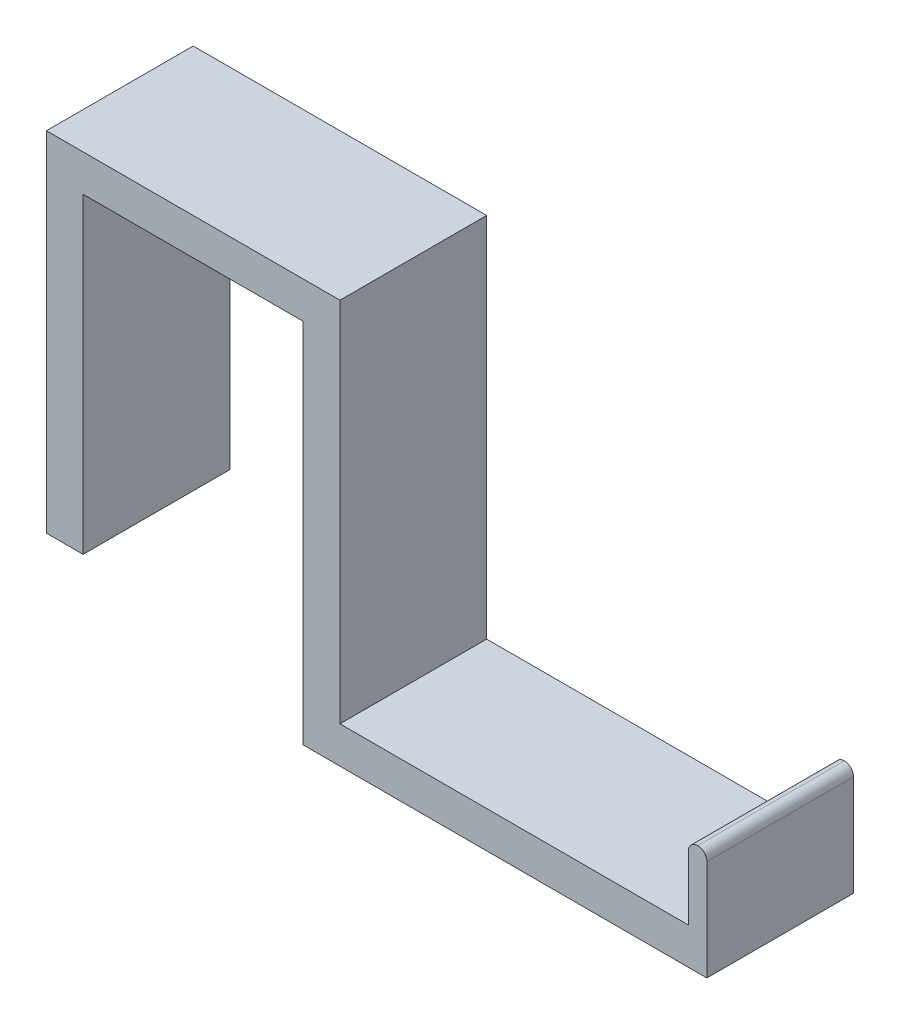
ISO-10303-21;
HEADER;
FILE_DESCRIPTION(('STEP AP214'),'2;1');
FILE_NAME('part.step','',(''),(''),'','','');
FILE_SCHEMA(('AUTOMOTIVE_DESIGN { 1 0 10303 214 1 1 1 1 }'));
ENDSEC;
DATA;
#1=APPLICATION_CONTEXT('core data for automotive mechanical design processes');
#2=APPLICATION_PROTOCOL_DEFINITION('international standard','automotive_design',2000,#1);
#3=PRODUCT_CONTEXT('',#1,'mechanical');
#4=PRODUCT('Part','Part','',(#3));
#5=PRODUCT_RELATED_PRODUCT_CATEGORY('part','',(#4));
#6=PRODUCT_DEFINITION_FORMATION('','',#4);
#7=PRODUCT_DEFINITION_CONTEXT('part definition',#1,'design');
#8=PRODUCT_DEFINITION('design','',#6,#7);
#9=PRODUCT_DEFINITION_SHAPE('','',#8);
#10=(LENGTH_UNIT() NAMED_UNIT(*) SI_UNIT(.MILLI.,.METRE.));
#11=(NAMED_UNIT(*) PLANE_ANGLE_UNIT() SI_UNIT($,.RADIAN.));
#12=(NAMED_UNIT(*) SI_UNIT($,.STERADIAN.) SOLID_ANGLE_UNIT());
#13=UNCERTAINTY_MEASURE_WITH_UNIT(LENGTH_MEASURE(1.E-05),#10,'distance_accuracy_value','');
#14=(GEOMETRIC_REPRESENTATION_CONTEXT(3) GLOBAL_UNCERTAINTY_ASSIGNED_CONTEXT((#13)) GLOBAL_UNIT_ASSIGNED_CONTEXT((#10,
#11,#12)) REPRESENTATION_CONTEXT('',''));
#15=CARTESIAN_POINT('',(0.,0.,0.));
#16=DIRECTION('',(0.,0.,1.));
#17=DIRECTION('',(1.,0.,0.));
#18=AXIS2_PLACEMENT_3D('',#15,#16,#17);
#19=CARTESIAN_POINT('',(-39.7323914253897,0.,40.));
#20=DIRECTION('',(1.,0.,0.));
#21=DIRECTION('',(0.,1.,0.));
#22=AXIS2_PLACEMENT_3D('',#19,#20,#21);
#23=PLANE('',#22);
#24=DIRECTION('',(0.,-1.,0.));
#25=VECTOR('',#24,1.);
#26=CARTESIAN_POINT('',(-39.7323914253897,0.,0.));
#27=LINE('',#26,#25);
#28=CARTESIAN_POINT('',(-39.7323914253897,33.59375,0.));
#29=VERTEX_POINT('',#28);
#30=CARTESIAN_POINT('',(-39.7323914253897,-66.40625,0.));
#31=VERTEX_POINT('',#30);
#32=EDGE_CURVE('E232',#29,#31,#27,.T.);
#33=ORIENTED_EDGE('',*,*,#32,.T.);
#34=DIRECTION('',(0.,0.,-1.));
#35=VECTOR('',#34,1.);
#36=CARTESIAN_POINT('',(-39.7323914253897,-66.40625,40.));
#37=LINE('',#36,#35);
#38=CARTESIAN_POINT('',(-39.7323914253897,-66.40625,40.));
#39=VERTEX_POINT('',#38);
#40=EDGE_CURVE('E201',#39,#31,#37,.T.);
#41=ORIENTED_EDGE('',*,*,#40,.F.);
#42=DIRECTION('',(0.,-1.,0.));
#43=VECTOR('',#42,1.);
#44=CARTESIAN_POINT('',(-39.7323914253897,0.,40.));
#45=LINE('',#44,#43);
#46=CARTESIAN_POINT('',(-39.7323914253897,33.59375,40.));
#47=VERTEX_POINT('',#46);
#48=EDGE_CURVE('E206',#47,#39,#45,.T.);
#49=ORIENTED_EDGE('',*,*,#48,.F.);
#50=DIRECTION('',(0.,0.,-1.));
#51=VECTOR('',#50,1.);
#52=CARTESIAN_POINT('',(-39.7323914253897,33.59375,40.));
#53=LINE('',#52,#51);
#54=EDGE_CURVE('E190',#47,#29,#53,.T.);
#55=ORIENTED_EDGE('',*,*,#54,.T.);
#56=EDGE_LOOP('',(#33,#41,#49,#55));
#57=FACE_BOUND('',#56,.T.);
#58=ADVANCED_FACE('F98',(#57),#23,.F.);
#59=CARTESIAN_POINT('',(0.,-66.40625,40.));
#60=DIRECTION('',(0.,1.,0.));
#61=DIRECTION('',(0.,0.,1.));
#62=AXIS2_PLACEMENT_3D('',#59,#60,#61);
#63=PLANE('',#62);
#64=DIRECTION('',(1.,0.,0.));
#65=VECTOR('',#64,1.);
#66=CARTESIAN_POINT('',(0.,-66.40625,0.));
#67=LINE('',#66,#65);
#68=CARTESIAN_POINT('',(70.2676085746103,-66.40625,0.));
#69=VERTEX_POINT('',#68);
#70=EDGE_CURVE('E235',#31,#69,#67,.T.);
#71=ORIENTED_EDGE('',*,*,#70,.T.);
#72=DIRECTION('',(0.,0.,-1.));
#73=VECTOR('',#72,1.);
#74=CARTESIAN_POINT('',(70.2676085746103,-66.40625,40.));
#75=LINE('',#74,#73);
#76=CARTESIAN_POINT('',(70.2676085746103,-66.40625,40.));
#77=VERTEX_POINT('',#76);
#78=EDGE_CURVE('E243',#77,#69,#75,.T.);
#79=ORIENTED_EDGE('',*,*,#78,.F.);
#80=DIRECTION('',(1.,0.,0.));
#81=VECTOR('',#80,1.);
#82=CARTESIAN_POINT('',(0.,-66.40625,40.));
#83=LINE('',#82,#81);
#84=EDGE_CURVE('E215',#39,#77,#83,.T.);
#85=ORIENTED_EDGE('',*,*,#84,.F.);
#86=ORIENTED_EDGE('',*,*,#40,.T.);
#87=EDGE_LOOP('',(#71,#79,#85,#86));
#88=FACE_BOUND('',#87,.T.);
#89=ADVANCED_FACE('F299',(#88),#63,.F.);
#90=CARTESIAN_POINT('',(70.2676085746103,0.,40.));
#91=DIRECTION('',(1.,0.,0.));
#92=DIRECTION('',(0.,0.,-1.));
#93=AXIS2_PLACEMENT_3D('',#90,#91,#92);
#94=PLANE('',#93);
#95=DIRECTION('',(0.,-1.,0.));
#96=VECTOR('',#95,1.);
#97=CARTESIAN_POINT('',(70.2676085746103,0.,0.));
#98=LINE('',#97,#96);
#99=CARTESIAN_POINT('',(70.2676085746103,-38.90625,0.));
#100=VERTEX_POINT('',#99);
#101=EDGE_CURVE('E238',#100,#69,#98,.T.);
#102=ORIENTED_EDGE('',*,*,#101,.F.);
#103=DIRECTION('',(0.,0.,-1.));
#104=VECTOR('',#103,1.);
#105=CARTESIAN_POINT('',(70.2676085746103,-38.90625,40.));
#106=LINE('',#105,#104);
#107=CARTESIAN_POINT('',(70.2676085746103,-38.90625,40.));
#108=VERTEX_POINT('',#107);
#109=EDGE_CURVE('E287',#100,#108,#106,.F.);
#110=ORIENTED_EDGE('',*,*,#109,.T.);
#111=DIRECTION('',(0.,-1.,0.));
#112=VECTOR('',#111,1.);
#113=CARTESIAN_POINT('',(70.2676085746103,0.,40.));
#114=LINE('',#113,#112);
#115=EDGE_CURVE('E218',#108,#77,#114,.T.);
#116=ORIENTED_EDGE('',*,*,#115,.T.);
#117=ORIENTED_EDGE('',*,*,#78,.T.);
#118=EDGE_LOOP('',(#102,#110,#116,#117));
#119=FACE_BOUND('',#118,.T.);
#120=ADVANCED_FACE('F294',(#119),#94,.T.);
#121=CARTESIAN_POINT('',(0.,-56.40625,40.));
#122=DIRECTION('',(0.,1.,0.));
#123=DIRECTION('',(0.,0.,1.));
#124=AXIS2_PLACEMENT_3D('',#121,#122,#123);
#125=PLANE('',#124);
#126=DIRECTION('',(0.,0.,1.));
#127=VECTOR('',#126,1.);
#128=CARTESIAN_POINT('',(65.2676085746103,-56.40625,40.));
#129=LINE('',#128,#127);
#130=CARTESIAN_POINT('',(65.2676085746103,-56.40625,0.));
#131=VERTEX_POINT('',#130);
#132=CARTESIAN_POINT('',(65.2676085746103,-56.40625,40.));
#133=VERTEX_POINT('',#132);
#134=EDGE_CURVE('E200',#131,#133,#129,.T.);
#135=ORIENTED_EDGE('',*,*,#134,.F.);
#136=DIRECTION('',(1.,0.,0.));
#137=VECTOR('',#136,1.);
#138=CARTESIAN_POINT('',(0.,-56.40625,0.));
#139=LINE('',#138,#137);
#140=CARTESIAN_POINT('',(-29.7323914253897,-56.40625,0.));
#141=VERTEX_POINT('',#140);
#142=EDGE_CURVE('E221',#141,#131,#139,.T.);
#143=ORIENTED_EDGE('',*,*,#142,.F.);
#144=DIRECTION('',(0.,0.,-1.));
#145=VECTOR('',#144,1.);
#146=CARTESIAN_POINT('',(-29.7323914253897,-56.40625,40.));
#147=LINE('',#146,#145);
#148=CARTESIAN_POINT('',(-29.7323914253897,-56.40625,40.));
#149=VERTEX_POINT('',#148);
#150=EDGE_CURVE('E228',#149,#141,#147,.T.);
#151=ORIENTED_EDGE('',*,*,#150,.F.);
#152=DIRECTION('',(1.,0.,0.));
#153=VECTOR('',#152,1.);
#154=CARTESIAN_POINT('',(0.,-56.40625,40.));
#155=LINE('',#154,#153);
#156=EDGE_CURVE('E225',#149,#133,#155,.T.);
#157=ORIENTED_EDGE('',*,*,#156,.T.);
#158=EDGE_LOOP('',(#135,#143,#151,#157));
#159=FACE_BOUND('',#158,.T.);
#160=ADVANCED_FACE('F315',(#159),#125,.T.);
#161=CARTESIAN_POINT('',(-29.7323914253897,0.,40.));
#162=DIRECTION('',(1.,0.,0.));
#163=DIRECTION('',(0.,1.,0.));
#164=AXIS2_PLACEMENT_3D('',#161,#162,#163);
#165=PLANE('',#164);
#166=DIRECTION('',(0.,-1.,0.));
#167=VECTOR('',#166,1.);
#168=CARTESIAN_POINT('',(-29.7323914253897,0.,0.));
#169=LINE('',#168,#167);
#170=CARTESIAN_POINT('',(-29.7323914253897,43.59375,0.));
#171=VERTEX_POINT('',#170);
#172=EDGE_CURVE('E229',#171,#141,#169,.T.);
#173=ORIENTED_EDGE('',*,*,#172,.F.);
#174=DIRECTION('',(0.,0.,-1.));
#175=VECTOR('',#174,1.);
#176=CARTESIAN_POINT('',(-29.7323914253897,43.59375,40.));
#177=LINE('',#176,#175);
#178=CARTESIAN_POINT('',(-29.7323914253897,43.59375,40.));
#179=VERTEX_POINT('',#178);
#180=EDGE_CURVE('E262',#179,#171,#177,.T.);
#181=ORIENTED_EDGE('',*,*,#180,.F.);
#182=DIRECTION('',(0.,-1.,0.));
#183=VECTOR('',#182,1.);
#184=CARTESIAN_POINT('',(-29.7323914253897,0.,40.));
#185=LINE('',#184,#183);
#186=EDGE_CURVE('E216',#179,#149,#185,.T.);
#187=ORIENTED_EDGE('',*,*,#186,.T.);
#188=ORIENTED_EDGE('',*,*,#150,.T.);
#189=EDGE_LOOP('',(#173,#181,#187,#188));
#190=FACE_BOUND('',#189,.T.);
#191=ADVANCED_FACE('F323',(#190),#165,.T.);
#192=CARTESIAN_POINT('',(0.,0.,0.));
#193=DIRECTION('',(0.,0.,1.));
#194=DIRECTION('',(1.,0.,0.));
#195=AXIS2_PLACEMENT_3D('',#192,#193,#194);
#196=PLANE('',#195);
#197=CARTESIAN_POINT('',(67.7676085746103,-38.90625,0.));
#198=DIRECTION('',(0.,0.,1.));
#199=DIRECTION('',(1.,0.,0.));
#200=AXIS2_PLACEMENT_3D('',#197,#198,#199);
#201=CIRCLE('',#200,2.5);
#202=CARTESIAN_POINT('',(65.2676085746103,-38.90625,0.));
#203=VERTEX_POINT('',#202);
#204=CARTESIAN_POINT('',(67.7676085746103,-36.40625,0.));
#205=VERTEX_POINT('',#204);
#206=EDGE_CURVE('E248',#203,#205,#201,.F.);
#207=ORIENTED_EDGE('',*,*,#206,.T.);
#208=CARTESIAN_POINT('',(67.7676085746103,-38.90625,0.));
#209=DIRECTION('',(0.,0.,1.));
#210=DIRECTION('',(1.,0.,0.));
#211=AXIS2_PLACEMENT_3D('',#208,#209,#210);
#212=CIRCLE('',#211,2.5);
#213=EDGE_CURVE('E285',#205,#100,#212,.F.);
#214=ORIENTED_EDGE('',*,*,#213,.T.);
#215=ORIENTED_EDGE('',*,*,#101,.T.);
#216=ORIENTED_EDGE('',*,*,#70,.F.);
#217=ORIENTED_EDGE('',*,*,#32,.F.);
#218=DIRECTION('',(-1.,0.,0.));
#219=VECTOR('',#218,1.);
#220=CARTESIAN_POINT('',(-29.7323914253897,33.59375,0.));
#221=LINE('',#220,#219);
#222=CARTESIAN_POINT('',(-99.7323914253897,33.59375,0.));
#223=VERTEX_POINT('',#222);
#224=EDGE_CURVE('E196',#29,#223,#221,.T.);
#225=ORIENTED_EDGE('',*,*,#224,.T.);
#226=DIRECTION('',(0.,-1.,0.));
#227=VECTOR('',#226,1.);
#228=CARTESIAN_POINT('',(-99.7323914253897,33.59375,0.));
#229=LINE('',#228,#227);
#230=CARTESIAN_POINT('',(-99.7323914253897,-51.40625,0.));
#231=VERTEX_POINT('',#230);
#232=EDGE_CURVE('E272',#223,#231,#229,.T.);
#233=ORIENTED_EDGE('',*,*,#232,.T.);
#234=DIRECTION('',(1.,0.,0.));
#235=VECTOR('',#234,1.);
#236=CARTESIAN_POINT('',(-109.73239142539,-51.40625,0.));
#237=LINE('',#236,#235);
#238=CARTESIAN_POINT('',(-109.73239142539,-51.40625,0.));
#239=VERTEX_POINT('',#238);
#240=EDGE_CURVE('E275',#239,#231,#237,.T.);
#241=ORIENTED_EDGE('',*,*,#240,.F.);
#242=DIRECTION('',(0.,1.,0.));
#243=VECTOR('',#242,1.);
#244=CARTESIAN_POINT('',(-109.73239142539,33.59375,0.));
#245=LINE('',#244,#243);
#246=CARTESIAN_POINT('',(-109.73239142539,43.59375,0.));
#247=VERTEX_POINT('',#246);
#248=EDGE_CURVE('E256',#239,#247,#245,.T.);
#249=ORIENTED_EDGE('',*,*,#248,.T.);
#250=DIRECTION('',(-1.,0.,0.));
#251=VECTOR('',#250,1.);
#252=CARTESIAN_POINT('',(-29.7323914253897,43.59375,0.));
#253=LINE('',#252,#251);
#254=EDGE_CURVE('E253',#171,#247,#253,.T.);
#255=ORIENTED_EDGE('',*,*,#254,.F.);
#256=ORIENTED_EDGE('',*,*,#172,.T.);
#257=ORIENTED_EDGE('',*,*,#142,.T.);
#258=DIRECTION('',(0.,1.,0.));
#259=VECTOR('',#258,1.);
#260=CARTESIAN_POINT('',(65.2676085746103,-56.40625,0.));
#261=LINE('',#260,#259);
#262=EDGE_CURVE('E266',#131,#203,#261,.T.);
#263=ORIENTED_EDGE('',*,*,#262,.T.);
#264=EDGE_LOOP('',(#207,#214,#215,#216,#217,#225,#233,#241,#249,#255,#256,#257,#263));
#265=FACE_BOUND('',#264,.T.);
#266=ADVANCED_FACE('F302',(#265),#196,.F.);
#267=CARTESIAN_POINT('',(0.,0.,40.));
#268=DIRECTION('',(0.,0.,1.));
#269=DIRECTION('',(1.,0.,0.));
#270=AXIS2_PLACEMENT_3D('',#267,#268,#269);
#271=PLANE('',#270);
#272=ORIENTED_EDGE('',*,*,#115,.F.);
#273=CARTESIAN_POINT('',(67.7676085746103,-38.90625,40.));
#274=DIRECTION('',(0.,0.,1.));
#275=DIRECTION('',(1.,0.,0.));
#276=AXIS2_PLACEMENT_3D('',#273,#274,#275);
#277=CIRCLE('',#276,2.5);
#278=CARTESIAN_POINT('',(67.7676085746103,-36.40625,40.));
#279=VERTEX_POINT('',#278);
#280=EDGE_CURVE('E107',#108,#279,#277,.T.);
#281=ORIENTED_EDGE('',*,*,#280,.T.);
#282=CARTESIAN_POINT('',(67.7676085746103,-38.90625,40.));
#283=DIRECTION('',(0.,0.,1.));
#284=DIRECTION('',(1.,0.,0.));
#285=AXIS2_PLACEMENT_3D('',#282,#283,#284);
#286=CIRCLE('',#285,2.5);
#287=CARTESIAN_POINT('',(65.2676085746103,-38.90625,40.));
#288=VERTEX_POINT('',#287);
#289=EDGE_CURVE('E114',#279,#288,#286,.T.);
#290=ORIENTED_EDGE('',*,*,#289,.T.);
#291=DIRECTION('',(0.,1.,0.));
#292=VECTOR('',#291,1.);
#293=CARTESIAN_POINT('',(65.2676085746103,-56.40625,40.));
#294=LINE('',#293,#292);
#295=EDGE_CURVE('E257',#133,#288,#294,.T.);
#296=ORIENTED_EDGE('',*,*,#295,.F.);
#297=ORIENTED_EDGE('',*,*,#156,.F.);
#298=ORIENTED_EDGE('',*,*,#186,.F.);
#299=DIRECTION('',(-1.,0.,0.));
#300=VECTOR('',#299,1.);
#301=CARTESIAN_POINT('',(-29.7323914253897,43.59375,40.));
#302=LINE('',#301,#300);
#303=CARTESIAN_POINT('',(-109.73239142539,43.59375,40.));
#304=VERTEX_POINT('',#303);
#305=EDGE_CURVE('E249',#179,#304,#302,.T.);
#306=ORIENTED_EDGE('',*,*,#305,.T.);
#307=DIRECTION('',(0.,1.,0.));
#308=VECTOR('',#307,1.);
#309=CARTESIAN_POINT('',(-109.73239142539,33.59375,40.));
#310=LINE('',#309,#308);
#311=CARTESIAN_POINT('',(-109.73239142539,-51.40625,40.));
#312=VERTEX_POINT('',#311);
#313=EDGE_CURVE('E211',#312,#304,#310,.T.);
#314=ORIENTED_EDGE('',*,*,#313,.F.);
#315=DIRECTION('',(1.,0.,0.));
#316=VECTOR('',#315,1.);
#317=CARTESIAN_POINT('',(-109.73239142539,-51.40625,40.));
#318=LINE('',#317,#316);
#319=CARTESIAN_POINT('',(-99.7323914253897,-51.40625,40.));
#320=VERTEX_POINT('',#319);
#321=EDGE_CURVE('E270',#312,#320,#318,.T.);
#322=ORIENTED_EDGE('',*,*,#321,.T.);
#323=DIRECTION('',(0.,-1.,0.));
#324=VECTOR('',#323,1.);
#325=CARTESIAN_POINT('',(-99.7323914253897,33.59375,40.));
#326=LINE('',#325,#324);
#327=CARTESIAN_POINT('',(-99.7323914253897,33.59375,40.));
#328=VERTEX_POINT('',#327);
#329=EDGE_CURVE('E209',#328,#320,#326,.T.);
#330=ORIENTED_EDGE('',*,*,#329,.F.);
#331=DIRECTION('',(-1.,0.,0.));
#332=VECTOR('',#331,1.);
#333=CARTESIAN_POINT('',(-29.7323914253897,33.59375,40.));
#334=LINE('',#333,#332);
#335=EDGE_CURVE('E194',#47,#328,#334,.T.);
#336=ORIENTED_EDGE('',*,*,#335,.F.);
#337=ORIENTED_EDGE('',*,*,#48,.T.);
#338=ORIENTED_EDGE('',*,*,#84,.T.);
#339=EDGE_LOOP('',(#272,#281,#290,#296,#297,#298,#306,#314,#322,#330,#336,#337,#338));
#340=FACE_BOUND('',#339,.T.);
#341=ADVANCED_FACE('F204',(#340),#271,.T.);
#342=CARTESIAN_POINT('',(65.2676085746103,-56.40625,40.));
#343=DIRECTION('',(-1.,0.,0.));
#344=DIRECTION('',(0.,0.,1.));
#345=AXIS2_PLACEMENT_3D('',#342,#343,#344);
#346=PLANE('',#345);
#347=ORIENTED_EDGE('',*,*,#295,.T.);
#348=DIRECTION('',(0.,0.,-1.));
#349=VECTOR('',#348,1.);
#350=CARTESIAN_POINT('',(65.2676085746103,-38.90625,40.));
#351=LINE('',#350,#349);
#352=EDGE_CURVE('E12',#288,#203,#351,.T.);
#353=ORIENTED_EDGE('',*,*,#352,.T.);
#354=ORIENTED_EDGE('',*,*,#262,.F.);
#355=ORIENTED_EDGE('',*,*,#134,.T.);
#356=EDGE_LOOP('',(#347,#353,#354,#355));
#357=FACE_BOUND('',#356,.T.);
#358=ADVANCED_FACE('F311',(#357),#346,.T.);
#359=CARTESIAN_POINT('',(-109.73239142539,-51.40625,40.));
#360=DIRECTION('',(0.,1.,0.));
#361=DIRECTION('',(0.,0.,1.));
#362=AXIS2_PLACEMENT_3D('',#359,#360,#361);
#363=PLANE('',#362);
#364=ORIENTED_EDGE('',*,*,#240,.T.);
#365=DIRECTION('',(0.,0.,-1.));
#366=VECTOR('',#365,1.);
#367=CARTESIAN_POINT('',(-99.7323914253897,-51.40625,40.));
#368=LINE('',#367,#366);
#369=EDGE_CURVE('E269',#320,#231,#368,.T.);
#370=ORIENTED_EDGE('',*,*,#369,.F.);
#371=ORIENTED_EDGE('',*,*,#321,.F.);
#372=DIRECTION('',(0.,0.,-1.));
#373=VECTOR('',#372,1.);
#374=CARTESIAN_POINT('',(-109.73239142539,-51.40625,40.));
#375=LINE('',#374,#373);
#376=EDGE_CURVE('E274',#312,#239,#375,.T.);
#377=ORIENTED_EDGE('',*,*,#376,.T.);
#378=EDGE_LOOP('',(#364,#370,#371,#377));
#379=FACE_BOUND('',#378,.T.);
#380=ADVANCED_FACE('F330',(#379),#363,.F.);
#381=CARTESIAN_POINT('',(-99.7323914253897,33.59375,40.));
#382=DIRECTION('',(1.,0.,0.));
#383=DIRECTION('',(0.,0.,-1.));
#384=AXIS2_PLACEMENT_3D('',#381,#382,#383);
#385=PLANE('',#384);
#386=ORIENTED_EDGE('',*,*,#232,.F.);
#387=DIRECTION('',(0.,0.,-1.));
#388=VECTOR('',#387,1.);
#389=CARTESIAN_POINT('',(-99.7323914253897,33.59375,40.));
#390=LINE('',#389,#388);
#391=EDGE_CURVE('E233',#328,#223,#390,.T.);
#392=ORIENTED_EDGE('',*,*,#391,.F.);
#393=ORIENTED_EDGE('',*,*,#329,.T.);
#394=ORIENTED_EDGE('',*,*,#369,.T.);
#395=EDGE_LOOP('',(#386,#392,#393,#394));
#396=FACE_BOUND('',#395,.T.);
#397=ADVANCED_FACE('F334',(#396),#385,.T.);
#398=CARTESIAN_POINT('',(-29.7323914253897,43.59375,40.));
#399=DIRECTION('',(0.,-1.,0.));
#400=DIRECTION('',(1.,0.,0.));
#401=AXIS2_PLACEMENT_3D('',#398,#399,#400);
#402=PLANE('',#401);
#403=ORIENTED_EDGE('',*,*,#254,.T.);
#404=DIRECTION('',(0.,0.,-1.));
#405=VECTOR('',#404,1.);
#406=CARTESIAN_POINT('',(-109.73239142539,43.59375,40.));
#407=LINE('',#406,#405);
#408=EDGE_CURVE('E210',#304,#247,#407,.T.);
#409=ORIENTED_EDGE('',*,*,#408,.F.);
#410=ORIENTED_EDGE('',*,*,#305,.F.);
#411=ORIENTED_EDGE('',*,*,#180,.T.);
#412=EDGE_LOOP('',(#403,#409,#410,#411));
#413=FACE_BOUND('',#412,.T.);
#414=ADVANCED_FACE('F322',(#413),#402,.F.);
#415=CARTESIAN_POINT('',(-109.73239142539,33.59375,40.));
#416=DIRECTION('',(-1.,0.,0.));
#417=DIRECTION('',(0.,0.,1.));
#418=AXIS2_PLACEMENT_3D('',#415,#416,#417);
#419=PLANE('',#418);
#420=ORIENTED_EDGE('',*,*,#248,.F.);
#421=ORIENTED_EDGE('',*,*,#376,.F.);
#422=ORIENTED_EDGE('',*,*,#313,.T.);
#423=ORIENTED_EDGE('',*,*,#408,.T.);
#424=EDGE_LOOP('',(#420,#421,#422,#423));
#425=FACE_BOUND('',#424,.T.);
#426=ADVANCED_FACE('F327',(#425),#419,.T.);
#427=CARTESIAN_POINT('',(-29.7323914253897,33.59375,40.));
#428=DIRECTION('',(0.,-1.,0.));
#429=DIRECTION('',(0.,0.,-1.));
#430=AXIS2_PLACEMENT_3D('',#427,#428,#429);
#431=PLANE('',#430);
#432=ORIENTED_EDGE('',*,*,#54,.F.);
#433=ORIENTED_EDGE('',*,*,#335,.T.);
#434=ORIENTED_EDGE('',*,*,#391,.T.);
#435=ORIENTED_EDGE('',*,*,#224,.F.);
#436=EDGE_LOOP('',(#432,#433,#434,#435));
#437=FACE_BOUND('',#436,.T.);
#438=ADVANCED_FACE('F192',(#437),#431,.T.);
#439=CARTESIAN_POINT('',(67.7676085746103,-38.90625,40.));
#440=DIRECTION('',(0.,0.,-1.));
#441=DIRECTION('',(-1.,0.,0.));
#442=AXIS2_PLACEMENT_3D('',#439,#440,#441);
#443=CYLINDRICAL_SURFACE('',#442,2.5);
#444=ORIENTED_EDGE('',*,*,#352,.F.);
#445=ORIENTED_EDGE('',*,*,#289,.F.);
#446=DIRECTION('',(0.,0.,-1.));
#447=VECTOR('',#446,1.);
#448=CARTESIAN_POINT('',(67.7676085746103,-36.40625,40.));
#449=LINE('',#448,#447);
#450=EDGE_CURVE('E102',#205,#279,#449,.F.);
#451=ORIENTED_EDGE('',*,*,#450,.F.);
#452=ORIENTED_EDGE('',*,*,#206,.F.);
#453=EDGE_LOOP('',(#444,#445,#451,#452));
#454=FACE_BOUND('',#453,.T.);
#455=ADVANCED_FACE('F100',(#454),#443,.T.);
#456=CARTESIAN_POINT('',(67.7676085746103,-38.90625,40.));
#457=DIRECTION('',(0.,0.,-1.));
#458=DIRECTION('',(-1.,0.,0.));
#459=AXIS2_PLACEMENT_3D('',#456,#457,#458);
#460=CYLINDRICAL_SURFACE('',#459,2.5);
#461=ORIENTED_EDGE('',*,*,#280,.F.);
#462=ORIENTED_EDGE('',*,*,#109,.F.);
#463=ORIENTED_EDGE('',*,*,#213,.F.);
#464=ORIENTED_EDGE('',*,*,#450,.T.);
#465=EDGE_LOOP('',(#461,#462,#463,#464));
#466=FACE_BOUND('',#465,.T.);
#467=ADVANCED_FACE('F306',(#466),#460,.T.);
#468=CLOSED_SHELL('',(#58,#89,#120,#160,#191,#266,#341,#358,#380,#397,#414,#426,#438,#455,#467));
#469=MANIFOLD_SOLID_BREP('B2',#468);
#470=ADVANCED_BREP_SHAPE_REPRESENTATION('',(#18,#469),#14);
#471=SHAPE_DEFINITION_REPRESENTATION(#9,#470);
ENDSEC;
END-ISO-10303-21;
